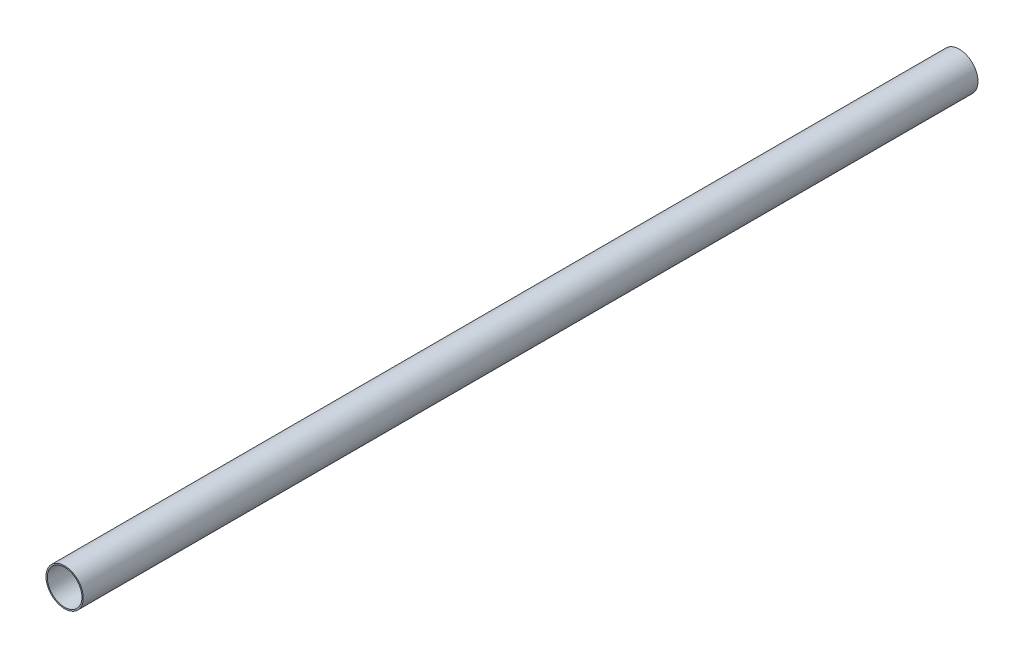
ISO-10303-21;
HEADER;
FILE_DESCRIPTION(('STEP AP214'),'2;1');
FILE_NAME('part.step','',(''),(''),'','','');
FILE_SCHEMA(('AUTOMOTIVE_DESIGN { 1 0 10303 214 1 1 1 1 }'));
ENDSEC;
DATA;
#1=APPLICATION_CONTEXT('core data for automotive mechanical design processes');
#2=APPLICATION_PROTOCOL_DEFINITION('international standard','automotive_design',2000,#1);
#3=PRODUCT_CONTEXT('',#1,'mechanical');
#4=PRODUCT('Part','Part','',(#3));
#5=PRODUCT_RELATED_PRODUCT_CATEGORY('part','',(#4));
#6=PRODUCT_DEFINITION_FORMATION('','',#4);
#7=PRODUCT_DEFINITION_CONTEXT('part definition',#1,'design');
#8=PRODUCT_DEFINITION('design','',#6,#7);
#9=PRODUCT_DEFINITION_SHAPE('','',#8);
#10=(LENGTH_UNIT() NAMED_UNIT(*) SI_UNIT(.MILLI.,.METRE.));
#11=(NAMED_UNIT(*) PLANE_ANGLE_UNIT() SI_UNIT($,.RADIAN.));
#12=(NAMED_UNIT(*) SI_UNIT($,.STERADIAN.) SOLID_ANGLE_UNIT());
#13=UNCERTAINTY_MEASURE_WITH_UNIT(LENGTH_MEASURE(1.E-05),#10,'distance_accuracy_value','');
#14=(GEOMETRIC_REPRESENTATION_CONTEXT(3) GLOBAL_UNCERTAINTY_ASSIGNED_CONTEXT((#13)) GLOBAL_UNIT_ASSIGNED_CONTEXT((#10,
#11,#12)) REPRESENTATION_CONTEXT('',''));
#15=CARTESIAN_POINT('',(0.,0.,0.));
#16=DIRECTION('',(0.,0.,1.));
#17=DIRECTION('',(1.,0.,0.));
#18=AXIS2_PLACEMENT_3D('',#15,#16,#17);
#19=CARTESIAN_POINT('',(0.,0.,304.8));
#20=DIRECTION('',(0.,0.,1.));
#21=DIRECTION('',(1.,0.,0.));
#22=AXIS2_PLACEMENT_3D('',#19,#20,#21);
#23=PLANE('',#22);
#24=CARTESIAN_POINT('',(0.,0.,304.8));
#25=DIRECTION('',(0.,0.,1.));
#26=DIRECTION('',(1.,0.,0.));
#27=AXIS2_PLACEMENT_3D('',#24,#25,#26);
#28=CIRCLE('',#27,6.35);
#29=CARTESIAN_POINT('',(6.35,0.,304.8));
#30=VERTEX_POINT('',#29);
#31=EDGE_CURVE('E10',#30,#30,#28,.T.);
#32=ORIENTED_EDGE('',*,*,#31,.T.);
#33=EDGE_LOOP('',(#32));
#34=FACE_BOUND('',#33,.T.);
#35=CARTESIAN_POINT('',(0.,0.,304.8));
#36=DIRECTION('',(0.,0.,1.));
#37=DIRECTION('',(1.,0.,0.));
#38=AXIS2_PLACEMENT_3D('',#35,#36,#37);
#39=CIRCLE('',#38,5.9055);
#40=CARTESIAN_POINT('',(5.9055,0.,304.8));
#41=VERTEX_POINT('',#40);
#42=EDGE_CURVE('E50',#41,#41,#39,.T.);
#43=ORIENTED_EDGE('',*,*,#42,.F.);
#44=EDGE_LOOP('',(#43));
#45=FACE_BOUND('',#44,.T.);
#46=ADVANCED_FACE('F37',(#34,#45),#23,.T.);
#47=CARTESIAN_POINT('',(0.,0.,0.));
#48=DIRECTION('',(0.,0.,1.));
#49=DIRECTION('',(1.,0.,0.));
#50=AXIS2_PLACEMENT_3D('',#47,#48,#49);
#51=PLANE('',#50);
#52=CARTESIAN_POINT('',(0.,0.,0.));
#53=DIRECTION('',(0.,0.,1.));
#54=DIRECTION('',(1.,0.,0.));
#55=AXIS2_PLACEMENT_3D('',#52,#53,#54);
#56=CIRCLE('',#55,6.35);
#57=CARTESIAN_POINT('',(6.35,0.,0.));
#58=VERTEX_POINT('',#57);
#59=EDGE_CURVE('E41',#58,#58,#56,.T.);
#60=ORIENTED_EDGE('',*,*,#59,.F.);
#61=EDGE_LOOP('',(#60));
#62=FACE_BOUND('',#61,.T.);
#63=CARTESIAN_POINT('',(0.,0.,0.));
#64=DIRECTION('',(0.,0.,1.));
#65=DIRECTION('',(1.,0.,0.));
#66=AXIS2_PLACEMENT_3D('',#63,#64,#65);
#67=CIRCLE('',#66,5.9055);
#68=CARTESIAN_POINT('',(5.9055,0.,0.));
#69=VERTEX_POINT('',#68);
#70=EDGE_CURVE('E52',#69,#69,#67,.T.);
#71=ORIENTED_EDGE('',*,*,#70,.T.);
#72=EDGE_LOOP('',(#71));
#73=FACE_BOUND('',#72,.T.);
#74=ADVANCED_FACE('F64',(#62,#73),#51,.F.);
#75=CARTESIAN_POINT('',(0.,0.,304.8));
#76=DIRECTION('',(0.,0.,-1.));
#77=DIRECTION('',(-1.,0.,0.));
#78=AXIS2_PLACEMENT_3D('',#75,#76,#77);
#79=CYLINDRICAL_SURFACE('',#78,6.35);
#80=ORIENTED_EDGE('',*,*,#31,.F.);
#81=EDGE_LOOP('',(#80));
#82=FACE_BOUND('',#81,.T.);
#83=ORIENTED_EDGE('',*,*,#59,.T.);
#84=EDGE_LOOP('',(#83));
#85=FACE_BOUND('',#84,.T.);
#86=ADVANCED_FACE('F39',(#82,#85),#79,.T.);
#87=CARTESIAN_POINT('',(0.,0.,304.8));
#88=DIRECTION('',(0.,0.,-1.));
#89=DIRECTION('',(-1.,0.,0.));
#90=AXIS2_PLACEMENT_3D('',#87,#88,#89);
#91=CYLINDRICAL_SURFACE('',#90,5.9055);
#92=ORIENTED_EDGE('',*,*,#42,.T.);
#93=EDGE_LOOP('',(#92));
#94=FACE_BOUND('',#93,.T.);
#95=ORIENTED_EDGE('',*,*,#70,.F.);
#96=EDGE_LOOP('',(#95));
#97=FACE_BOUND('',#96,.T.);
#98=ADVANCED_FACE('F60',(#94,#97),#91,.F.);
#99=CLOSED_SHELL('',(#46,#74,#86,#98));
#100=MANIFOLD_SOLID_BREP('B2',#99);
#101=ADVANCED_BREP_SHAPE_REPRESENTATION('',(#18,#100),#14);
#102=SHAPE_DEFINITION_REPRESENTATION(#9,#101);
ENDSEC;
END-ISO-10303-21;
